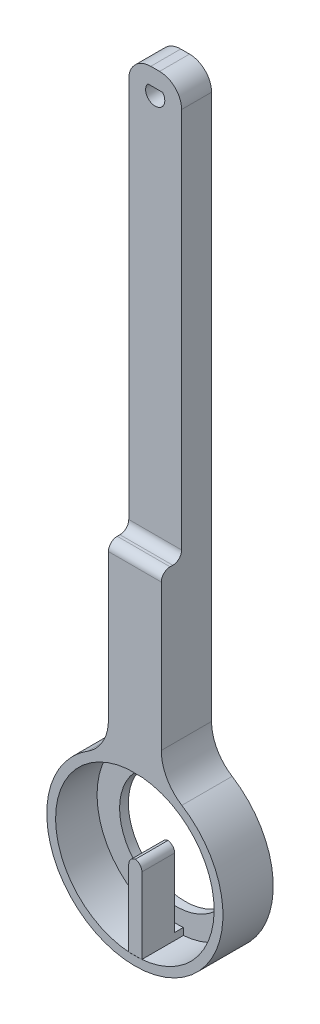
ISO-10303-21;
HEADER;
FILE_DESCRIPTION(('STEP AP214'),'2;1');
FILE_NAME('part.step','',(''),(''),'','','');
FILE_SCHEMA(('AUTOMOTIVE_DESIGN { 1 0 10303 214 1 1 1 1 }'));
ENDSEC;
DATA;
#1=APPLICATION_CONTEXT('core data for automotive mechanical design processes');
#2=APPLICATION_PROTOCOL_DEFINITION('international standard','automotive_design',2000,#1);
#3=PRODUCT_CONTEXT('',#1,'mechanical');
#4=PRODUCT('Part','Part','',(#3));
#5=PRODUCT_RELATED_PRODUCT_CATEGORY('part','',(#4));
#6=PRODUCT_DEFINITION_FORMATION('','',#4);
#7=PRODUCT_DEFINITION_CONTEXT('part definition',#1,'design');
#8=PRODUCT_DEFINITION('design','',#6,#7);
#9=PRODUCT_DEFINITION_SHAPE('','',#8);
#10=(LENGTH_UNIT() NAMED_UNIT(*) SI_UNIT(.MILLI.,.METRE.));
#11=(NAMED_UNIT(*) PLANE_ANGLE_UNIT() SI_UNIT($,.RADIAN.));
#12=(NAMED_UNIT(*) SI_UNIT($,.STERADIAN.) SOLID_ANGLE_UNIT());
#13=UNCERTAINTY_MEASURE_WITH_UNIT(LENGTH_MEASURE(1.E-05),#10,'distance_accuracy_value','');
#14=(GEOMETRIC_REPRESENTATION_CONTEXT(3) GLOBAL_UNCERTAINTY_ASSIGNED_CONTEXT((#13)) GLOBAL_UNIT_ASSIGNED_CONTEXT((#10,
#11,#12)) REPRESENTATION_CONTEXT('',''));
#15=CARTESIAN_POINT('',(0.,0.,0.));
#16=DIRECTION('',(0.,0.,1.));
#17=DIRECTION('',(1.,0.,0.));
#18=AXIS2_PLACEMENT_3D('',#15,#16,#17);
#19=CARTESIAN_POINT('',(0.359349427132485,-88.1961999037174,24.));
#20=DIRECTION('',(0.,0.,-1.));
#21=DIRECTION('',(-1.,0.,0.));
#22=AXIS2_PLACEMENT_3D('',#19,#20,#21);
#23=CYLINDRICAL_SURFACE('',#22,1.75);
#24=DIRECTION('',(0.,0.,-1.));
#25=VECTOR('',#24,1.);
#26=CARTESIAN_POINT('',(-1.39065057286751,-88.1961999037174,24.));
#27=LINE('',#26,#25);
#28=CARTESIAN_POINT('',(-1.39065057286751,-88.1961999037174,11.4140859188602));
#29=VERTEX_POINT('',#28);
#30=CARTESIAN_POINT('',(-1.39065057286751,-88.1961999037174,4.));
#31=VERTEX_POINT('',#30);
#32=EDGE_CURVE('E135',#29,#31,#27,.T.);
#33=ORIENTED_EDGE('',*,*,#32,.F.);
#34=CARTESIAN_POINT('',(0.359349427132485,-88.1961999037174,11.4140859188602));
#35=DIRECTION('',(0.,0.,1.));
#36=DIRECTION('',(0.,-1.,0.));
#37=AXIS2_PLACEMENT_3D('',#34,#35,#36);
#38=CIRCLE('',#37,1.75);
#39=CARTESIAN_POINT('',(0.109349427132485,-86.4641490961485,11.4140859188602));
#40=VERTEX_POINT('',#39);
#41=EDGE_CURVE('E128',#29,#40,#38,.F.);
#42=ORIENTED_EDGE('',*,*,#41,.T.);
#43=DIRECTION('',(0.,0.,-1.));
#44=VECTOR('',#43,1.);
#45=CARTESIAN_POINT('',(0.109349427132484,-86.4641490961485,13.));
#46=LINE('',#45,#44);
#47=CARTESIAN_POINT('',(0.109349427132484,-86.4641490961485,4.));
#48=VERTEX_POINT('',#47);
#49=EDGE_CURVE('E127',#48,#40,#46,.F.);
#50=ORIENTED_EDGE('',*,*,#49,.F.);
#51=CARTESIAN_POINT('',(0.359349427132485,-88.1961999037174,4.));
#52=DIRECTION('',(0.,0.,-1.));
#53=DIRECTION('',(-1.,0.,0.));
#54=AXIS2_PLACEMENT_3D('',#51,#52,#53);
#55=CIRCLE('',#54,1.75);
#56=EDGE_CURVE('E80',#48,#31,#55,.F.);
#57=ORIENTED_EDGE('',*,*,#56,.T.);
#58=EDGE_LOOP('',(#33,#42,#50,#57));
#59=FACE_BOUND('',#58,.T.);
#60=ADVANCED_FACE('F59',(#59),#23,.T.);
#61=CARTESIAN_POINT('',(-0.140650572867517,-88.1961999037174,24.));
#62=DIRECTION('',(0.,0.,-1.));
#63=DIRECTION('',(-1.,0.,0.));
#64=AXIS2_PLACEMENT_3D('',#61,#62,#63);
#65=CYLINDRICAL_SURFACE('',#64,1.75);
#66=ORIENTED_EDGE('',*,*,#49,.T.);
#67=CARTESIAN_POINT('',(-0.140650572867517,-88.1961999037174,11.4140859188602));
#68=DIRECTION('',(0.,0.,1.));
#69=DIRECTION('',(0.,-1.,0.));
#70=AXIS2_PLACEMENT_3D('',#67,#68,#69);
#71=CIRCLE('',#70,1.75);
#72=CARTESIAN_POINT('',(1.60934942713248,-88.1961999037174,11.4140859188602));
#73=VERTEX_POINT('',#72);
#74=EDGE_CURVE('E116',#40,#73,#71,.F.);
#75=ORIENTED_EDGE('',*,*,#74,.T.);
#76=DIRECTION('',(0.,0.,-1.));
#77=VECTOR('',#76,1.);
#78=CARTESIAN_POINT('',(1.60934942713248,-88.1961999037174,24.));
#79=LINE('',#78,#77);
#80=CARTESIAN_POINT('',(1.60934942713248,-88.1961999037174,4.));
#81=VERTEX_POINT('',#80);
#82=EDGE_CURVE('E125',#81,#73,#79,.F.);
#83=ORIENTED_EDGE('',*,*,#82,.F.);
#84=CARTESIAN_POINT('',(-0.140650572867517,-88.1961999037174,4.));
#85=DIRECTION('',(0.,0.,-1.));
#86=DIRECTION('',(-1.,0.,0.));
#87=AXIS2_PLACEMENT_3D('',#84,#85,#86);
#88=CIRCLE('',#87,1.75);
#89=EDGE_CURVE('E138',#81,#48,#88,.F.);
#90=ORIENTED_EDGE('',*,*,#89,.T.);
#91=EDGE_LOOP('',(#66,#75,#83,#90));
#92=FACE_BOUND('',#91,.T.);
#93=ADVANCED_FACE('F124',(#92),#65,.T.);
#94=CARTESIAN_POINT('',(-1.39065057286751,-105.446199903717,24.));
#95=DIRECTION('',(-1.,0.,0.));
#96=DIRECTION('',(0.,0.,1.));
#97=AXIS2_PLACEMENT_3D('',#94,#95,#96);
#98=PLANE('',#97);
#99=DIRECTION('',(0.,0.,-1.));
#100=VECTOR('',#99,1.);
#101=CARTESIAN_POINT('',(-1.39065057286751,-105.446199903717,24.));
#102=LINE('',#101,#100);
#103=CARTESIAN_POINT('',(-1.39065057286751,-105.446199903717,11.4140859188602));
#104=VERTEX_POINT('',#103);
#105=CARTESIAN_POINT('',(-1.39065057286751,-105.446199903717,2.));
#106=VERTEX_POINT('',#105);
#107=EDGE_CURVE('E136',#104,#106,#102,.T.);
#108=ORIENTED_EDGE('',*,*,#107,.F.);
#109=DIRECTION('',(0.,1.,0.));
#110=VECTOR('',#109,1.);
#111=CARTESIAN_POINT('',(-1.39065057286751,-105.446199903717,11.4140859188602));
#112=LINE('',#111,#110);
#113=EDGE_CURVE('E129',#104,#29,#112,.T.);
#114=ORIENTED_EDGE('',*,*,#113,.T.);
#115=ORIENTED_EDGE('',*,*,#32,.T.);
#116=DIRECTION('',(0.,-1.,0.));
#117=VECTOR('',#116,1.);
#118=CARTESIAN_POINT('',(-1.39065057286751,-105.446199903717,4.));
#119=LINE('',#118,#117);
#120=CARTESIAN_POINT('',(-1.39065057286751,-103.836744529305,4.));
#121=VERTEX_POINT('',#120);
#122=EDGE_CURVE('E163',#31,#121,#119,.T.);
#123=ORIENTED_EDGE('',*,*,#122,.T.);
#124=DIRECTION('',(0.,0.,-1.));
#125=VECTOR('',#124,1.);
#126=CARTESIAN_POINT('',(-1.39065057286751,-103.836744529305,4.));
#127=LINE('',#126,#125);
#128=CARTESIAN_POINT('',(-1.39065057286751,-103.836744529305,2.));
#129=VERTEX_POINT('',#128);
#130=EDGE_CURVE('E146',#129,#121,#127,.F.);
#131=ORIENTED_EDGE('',*,*,#130,.F.);
#132=DIRECTION('',(0.,1.,0.));
#133=VECTOR('',#132,1.);
#134=CARTESIAN_POINT('',(-1.39065057286751,-105.446199903717,2.));
#135=LINE('',#134,#133);
#136=EDGE_CURVE('E145',#106,#129,#135,.T.);
#137=ORIENTED_EDGE('',*,*,#136,.F.);
#138=EDGE_LOOP('',(#108,#114,#115,#123,#131,#137));
#139=FACE_BOUND('',#138,.T.);
#140=ADVANCED_FACE('F162',(#139),#98,.T.);
#141=CARTESIAN_POINT('',(-1.39065057286751,-105.446199903717,24.));
#142=DIRECTION('',(-0.00609617310807327,0.999981418164076,0.));
#143=DIRECTION('',(-0.999981418164076,-0.00609617310807327,0.));
#144=AXIS2_PLACEMENT_3D('',#141,#142,#143);
#145=PLANE('',#144);
#146=DIRECTION('',(0.999981418164076,0.00609617310807327,0.));
#147=VECTOR('',#146,1.);
#148=CARTESIAN_POINT('',(-1.39065057286751,-105.446199903717,11.4140859188602));
#149=LINE('',#148,#147);
#150=CARTESIAN_POINT('',(1.60934942713249,-105.427911044553,11.4140859188602));
#151=VERTEX_POINT('',#150);
#152=EDGE_CURVE('E73',#104,#151,#149,.T.);
#153=ORIENTED_EDGE('',*,*,#152,.F.);
#154=ORIENTED_EDGE('',*,*,#107,.T.);
#155=DIRECTION('',(0.999981418164076,0.00609617310807327,0.));
#156=VECTOR('',#155,1.);
#157=CARTESIAN_POINT('',(-1.39065057286751,-105.446199903717,2.));
#158=LINE('',#157,#156);
#159=CARTESIAN_POINT('',(1.60934942713249,-105.427911044553,2.));
#160=VERTEX_POINT('',#159);
#161=EDGE_CURVE('E168',#106,#160,#158,.T.);
#162=ORIENTED_EDGE('',*,*,#161,.T.);
#163=DIRECTION('',(0.,0.,-1.));
#164=VECTOR('',#163,1.);
#165=CARTESIAN_POINT('',(1.60934942713249,-105.427911044553,24.));
#166=LINE('',#165,#164);
#167=EDGE_CURVE('E140',#151,#160,#166,.T.);
#168=ORIENTED_EDGE('',*,*,#167,.F.);
#169=EDGE_LOOP('',(#153,#154,#162,#168));
#170=FACE_BOUND('',#169,.T.);
#171=ADVANCED_FACE('F175',(#170),#145,.F.);
#172=CARTESIAN_POINT('',(1.60934942713248,-86.4461999037174,24.));
#173=DIRECTION('',(1.,0.,0.));
#174=DIRECTION('',(0.,1.,0.));
#175=AXIS2_PLACEMENT_3D('',#172,#173,#174);
#176=PLANE('',#175);
#177=ORIENTED_EDGE('',*,*,#82,.T.);
#178=DIRECTION('',(0.,-1.,0.));
#179=VECTOR('',#178,1.);
#180=CARTESIAN_POINT('',(1.60934942713248,-86.4461999037174,11.4140859188602));
#181=LINE('',#180,#179);
#182=EDGE_CURVE('E12',#73,#151,#181,.T.);
#183=ORIENTED_EDGE('',*,*,#182,.T.);
#184=ORIENTED_EDGE('',*,*,#167,.T.);
#185=DIRECTION('',(0.,-1.,0.));
#186=VECTOR('',#185,1.);
#187=CARTESIAN_POINT('',(1.60934942713248,-86.4461999037174,2.));
#188=LINE('',#187,#186);
#189=CARTESIAN_POINT('',(1.60934942713249,-103.81665177826,2.));
#190=VERTEX_POINT('',#189);
#191=EDGE_CURVE('E169',#190,#160,#188,.T.);
#192=ORIENTED_EDGE('',*,*,#191,.F.);
#193=DIRECTION('',(0.,0.,-1.));
#194=VECTOR('',#193,1.);
#195=CARTESIAN_POINT('',(1.60934942713249,-103.81665177826,4.));
#196=LINE('',#195,#194);
#197=CARTESIAN_POINT('',(1.60934942713249,-103.81665177826,4.));
#198=VERTEX_POINT('',#197);
#199=EDGE_CURVE('E153',#198,#190,#196,.T.);
#200=ORIENTED_EDGE('',*,*,#199,.F.);
#201=DIRECTION('',(0.,1.,0.));
#202=VECTOR('',#201,1.);
#203=CARTESIAN_POINT('',(1.60934942713248,-86.4461999037174,4.));
#204=LINE('',#203,#202);
#205=EDGE_CURVE('E134',#198,#81,#204,.T.);
#206=ORIENTED_EDGE('',*,*,#205,.T.);
#207=EDGE_LOOP('',(#177,#183,#184,#192,#200,#206));
#208=FACE_BOUND('',#207,.T.);
#209=ADVANCED_FACE('F132',(#208),#176,.T.);
#210=CARTESIAN_POINT('',(0.,0.,2.));
#211=DIRECTION('',(0.,0.,-1.));
#212=DIRECTION('',(-1.,0.,0.));
#213=AXIS2_PLACEMENT_3D('',#210,#211,#212);
#214=PLANE('',#213);
#215=CARTESIAN_POINT('',(0.,-87.5,2.));
#216=DIRECTION('',(0.,0.,-1.));
#217=DIRECTION('',(-1.,0.,0.));
#218=AXIS2_PLACEMENT_3D('',#215,#216,#217);
#219=CIRCLE('',#218,16.3958266284931);
#220=EDGE_CURVE('E66',#190,#129,#219,.T.);
#221=ORIENTED_EDGE('',*,*,#220,.F.);
#222=ORIENTED_EDGE('',*,*,#191,.T.);
#223=ORIENTED_EDGE('',*,*,#161,.F.);
#224=ORIENTED_EDGE('',*,*,#136,.T.);
#225=EDGE_LOOP('',(#221,#222,#223,#224));
#226=FACE_BOUND('',#225,.T.);
#227=ADVANCED_FACE('F166',(#226),#214,.T.);
#228=CARTESIAN_POINT('',(0.,-87.5,4.));
#229=DIRECTION('',(0.,0.,-1.));
#230=DIRECTION('',(-1.,0.,0.));
#231=AXIS2_PLACEMENT_3D('',#228,#229,#230);
#232=CYLINDRICAL_SURFACE('',#231,16.3958266284931);
#233=ORIENTED_EDGE('',*,*,#130,.T.);
#234=CARTESIAN_POINT('',(0.,-87.5,4.));
#235=DIRECTION('',(0.,0.,-1.));
#236=DIRECTION('',(-1.,0.,0.));
#237=AXIS2_PLACEMENT_3D('',#234,#235,#236);
#238=CIRCLE('',#237,16.3958266284931);
#239=EDGE_CURVE('E181',#198,#121,#238,.T.);
#240=ORIENTED_EDGE('',*,*,#239,.F.);
#241=ORIENTED_EDGE('',*,*,#199,.T.);
#242=ORIENTED_EDGE('',*,*,#220,.T.);
#243=EDGE_LOOP('',(#233,#240,#241,#242));
#244=FACE_BOUND('',#243,.T.);
#245=ADVANCED_FACE('F150',(#244),#232,.F.);
#246=CARTESIAN_POINT('',(0.,-87.5,4.));
#247=DIRECTION('',(0.,0.,-1.));
#248=DIRECTION('',(-1.,0.,0.));
#249=AXIS2_PLACEMENT_3D('',#246,#247,#248);
#250=PLANE('',#249);
#251=ORIENTED_EDGE('',*,*,#56,.F.);
#252=ORIENTED_EDGE('',*,*,#89,.F.);
#253=ORIENTED_EDGE('',*,*,#205,.F.);
#254=ORIENTED_EDGE('',*,*,#239,.T.);
#255=ORIENTED_EDGE('',*,*,#122,.F.);
#256=EDGE_LOOP('',(#251,#252,#253,#254,#255));
#257=FACE_BOUND('',#256,.T.);
#258=ADVANCED_FACE('F187',(#257),#250,.T.);
#259=CARTESIAN_POINT('',(-35.,-27.0166279198616,11.4140859188601));
#260=DIRECTION('',(0.,0.,1.));
#261=DIRECTION('',(0.,-1.,0.));
#262=AXIS2_PLACEMENT_3D('',#259,#260,#261);
#263=PLANE('',#262);
#264=ORIENTED_EDGE('',*,*,#113,.F.);
#265=ORIENTED_EDGE('',*,*,#152,.T.);
#266=ORIENTED_EDGE('',*,*,#182,.F.);
#267=ORIENTED_EDGE('',*,*,#74,.F.);
#268=ORIENTED_EDGE('',*,*,#41,.F.);
#269=EDGE_LOOP('',(#264,#265,#266,#267,#268));
#270=FACE_BOUND('',#269,.T.);
#271=ADVANCED_FACE('F115',(#270),#263,.T.);
#272=CLOSED_SHELL('',(#60,#93,#140,#171,#209,#227,#245,#258,#271));
#273=MANIFOLD_SOLID_BREP('B2',#272);
#274=CARTESIAN_POINT('',(0.,-87.5,13.));
#275=DIRECTION('',(0.,0.,-1.));
#276=DIRECTION('',(-1.,0.,0.));
#277=AXIS2_PLACEMENT_3D('',#274,#275,#276);
#278=CYLINDRICAL_SURFACE('',#277,20.);
#279=CARTESIAN_POINT('',(0.,-87.5,11.4140859188602));
#280=DIRECTION('',(0.,0.,1.));
#281=DIRECTION('',(0.,-1.,0.));
#282=AXIS2_PLACEMENT_3D('',#279,#280,#281);
#283=CIRCLE('',#282,20.);
#284=CARTESIAN_POINT('',(-10.6666666666667,-70.581896612734,11.4140859188602));
#285=VERTEX_POINT('',#284);
#286=CARTESIAN_POINT('',(10.6666666666667,-70.581896612734,11.4140859188602));
#287=VERTEX_POINT('',#286);
#288=EDGE_CURVE('E400',#285,#287,#283,.T.);
#289=ORIENTED_EDGE('',*,*,#288,.F.);
#290=DIRECTION('',(0.,0.,-1.));
#291=VECTOR('',#290,1.);
#292=CARTESIAN_POINT('',(-10.6666666666667,-70.581896612734,13.));
#293=LINE('',#292,#291);
#294=CARTESIAN_POINT('',(-10.6666666666667,-70.581896612734,0.));
#295=VERTEX_POINT('',#294);
#296=EDGE_CURVE('E491',#285,#295,#293,.T.);
#297=ORIENTED_EDGE('',*,*,#296,.T.);
#298=CARTESIAN_POINT('',(0.,-87.5,0.));
#299=DIRECTION('',(0.,0.,1.));
#300=DIRECTION('',(1.,0.,0.));
#301=AXIS2_PLACEMENT_3D('',#298,#299,#300);
#302=CIRCLE('',#301,20.);
#303=CARTESIAN_POINT('',(10.6666666666667,-70.581896612734,0.));
#304=VERTEX_POINT('',#303);
#305=EDGE_CURVE('E444',#295,#304,#302,.T.);
#306=ORIENTED_EDGE('',*,*,#305,.T.);
#307=DIRECTION('',(0.,0.,-1.));
#308=VECTOR('',#307,1.);
#309=CARTESIAN_POINT('',(10.6666666666667,-70.581896612734,13.));
#310=LINE('',#309,#308);
#311=EDGE_CURVE('E488',#304,#287,#310,.F.);
#312=ORIENTED_EDGE('',*,*,#311,.T.);
#313=EDGE_LOOP('',(#289,#297,#306,#312));
#314=FACE_BOUND('',#313,.T.);
#315=ADVANCED_FACE('F261',(#314),#278,.T.);
#316=CARTESIAN_POINT('',(0.,-87.5000000000001,2.));
#317=DIRECTION('',(0.,0.,1.));
#318=DIRECTION('',(1.,0.,0.));
#319=AXIS2_PLACEMENT_3D('',#316,#317,#318);
#320=CYLINDRICAL_SURFACE('',#319,18.);
#321=CARTESIAN_POINT('',(0.,-87.5000000000001,11.4140859188602));
#322=DIRECTION('',(0.,0.,1.));
#323=DIRECTION('',(0.,-1.,0.));
#324=AXIS2_PLACEMENT_3D('',#321,#322,#323);
#325=CIRCLE('',#324,18.);
#326=CARTESIAN_POINT('',(1.78406217918483,-69.5886314833065,11.4140859188602));
#327=VERTEX_POINT('',#326);
#328=CARTESIAN_POINT('',(-1.78406217918483,-69.5886314833065,11.4140859188602));
#329=VERTEX_POINT('',#328);
#330=EDGE_CURVE('E407',#327,#329,#325,.F.);
#331=ORIENTED_EDGE('',*,*,#330,.F.);
#332=DIRECTION('',(0.,0.,1.));
#333=VECTOR('',#332,1.);
#334=CARTESIAN_POINT('',(1.78406217918483,-69.5886314833065,2.));
#335=LINE('',#334,#333);
#336=CARTESIAN_POINT('',(1.78406217918483,-69.5886314833065,2.));
#337=VERTEX_POINT('',#336);
#338=EDGE_CURVE('E433',#327,#337,#335,.F.);
#339=ORIENTED_EDGE('',*,*,#338,.T.);
#340=CARTESIAN_POINT('',(0.,-87.5000000000001,2.));
#341=DIRECTION('',(0.,0.,1.));
#342=DIRECTION('',(1.,0.,0.));
#343=AXIS2_PLACEMENT_3D('',#340,#341,#342);
#344=CIRCLE('',#343,18.);
#345=CARTESIAN_POINT('',(-1.78406217918483,-69.5886314833065,2.));
#346=VERTEX_POINT('',#345);
#347=EDGE_CURVE('E439',#346,#337,#344,.T.);
#348=ORIENTED_EDGE('',*,*,#347,.F.);
#349=DIRECTION('',(0.,0.,1.));
#350=VECTOR('',#349,1.);
#351=CARTESIAN_POINT('',(-1.78406217918483,-69.5886314833065,2.));
#352=LINE('',#351,#350);
#353=EDGE_CURVE('E428',#346,#329,#352,.T.);
#354=ORIENTED_EDGE('',*,*,#353,.T.);
#355=EDGE_LOOP('',(#331,#339,#348,#354));
#356=FACE_BOUND('',#355,.T.);
#357=ADVANCED_FACE('F562',(#356),#320,.F.);
#358=CARTESIAN_POINT('',(5.99999999999998,-69.5886314833065,15.8));
#359=DIRECTION('',(0.,-1.,0.));
#360=DIRECTION('',(0.,0.,-1.));
#361=AXIS2_PLACEMENT_3D('',#358,#359,#360);
#362=PLANE('',#361);
#363=ORIENTED_EDGE('',*,*,#338,.F.);
#364=DIRECTION('',(-1.,0.,0.));
#365=VECTOR('',#364,1.);
#366=CARTESIAN_POINT('',(5.99999999999998,-69.5886314833065,11.4140859188602));
#367=LINE('',#366,#365);
#368=EDGE_CURVE('E404',#327,#329,#367,.T.);
#369=ORIENTED_EDGE('',*,*,#368,.T.);
#370=ORIENTED_EDGE('',*,*,#353,.F.);
#371=DIRECTION('',(1.,0.,0.));
#372=VECTOR('',#371,1.);
#373=CARTESIAN_POINT('',(0.,-69.5886314833065,2.));
#374=LINE('',#373,#372);
#375=EDGE_CURVE('E447',#346,#337,#374,.T.);
#376=ORIENTED_EDGE('',*,*,#375,.T.);
#377=EDGE_LOOP('',(#363,#369,#370,#376));
#378=FACE_BOUND('',#377,.T.);
#379=ADVANCED_FACE('F569',(#378),#362,.T.);
#380=CARTESIAN_POINT('',(5.99999999999998,-69.5886314833065,15.8));
#381=DIRECTION('',(1.,0.,0.));
#382=DIRECTION('',(0.,0.,-1.));
#383=AXIS2_PLACEMENT_3D('',#380,#381,#382);
#384=PLANE('',#383);
#385=DIRECTION('',(0.,-1.,0.));
#386=VECTOR('',#385,1.);
#387=CARTESIAN_POINT('',(5.99999999999998,-69.5886314833065,11.4140859188602));
#388=LINE('',#387,#386);
#389=CARTESIAN_POINT('',(5.99999999999998,-29.0166279198616,11.4140859188601));
#390=VERTEX_POINT('',#389);
#391=CARTESIAN_POINT('',(5.99999999999998,-62.1228449191009,11.4140859188601));
#392=VERTEX_POINT('',#391);
#393=EDGE_CURVE('E402',#390,#392,#388,.T.);
#394=ORIENTED_EDGE('',*,*,#393,.T.);
#395=DIRECTION('',(0.,0.,-1.));
#396=VECTOR('',#395,1.);
#397=CARTESIAN_POINT('',(5.99999999999998,-62.1228449191009,15.8));
#398=LINE('',#397,#396);
#399=CARTESIAN_POINT('',(5.99999999999998,-62.1228449191009,0.));
#400=VERTEX_POINT('',#399);
#401=EDGE_CURVE('E276',#392,#400,#398,.T.);
#402=ORIENTED_EDGE('',*,*,#401,.T.);
#403=DIRECTION('',(0.,-1.,0.));
#404=VECTOR('',#403,1.);
#405=CARTESIAN_POINT('',(5.99999999999998,-69.5886314833065,0.));
#406=LINE('',#405,#404);
#407=CARTESIAN_POINT('',(5.99999999999998,61.5832427245863,0.));
#408=VERTEX_POINT('',#407);
#409=EDGE_CURVE('E418',#408,#400,#406,.T.);
#410=ORIENTED_EDGE('',*,*,#409,.F.);
#411=DIRECTION('',(0.,0.,-1.));
#412=VECTOR('',#411,1.);
#413=CARTESIAN_POINT('',(5.99999999999998,61.5832427245863,15.8));
#414=LINE('',#413,#412);
#415=CARTESIAN_POINT('',(5.99999999999998,61.5832427245863,6.79999999999999));
#416=VERTEX_POINT('',#415);
#417=EDGE_CURVE('E459',#408,#416,#414,.F.);
#418=ORIENTED_EDGE('',*,*,#417,.T.);
#419=DIRECTION('',(0.,-1.,0.));
#420=VECTOR('',#419,1.);
#421=CARTESIAN_POINT('',(5.99999999999998,-27.0166279198616,6.79999999999999));
#422=LINE('',#421,#420);
#423=CARTESIAN_POINT('',(5.99999999999998,-25.0166279198616,6.79999999999999));
#424=VERTEX_POINT('',#423);
#425=EDGE_CURVE('E410',#416,#424,#422,.T.);
#426=ORIENTED_EDGE('',*,*,#425,.T.);
#427=CARTESIAN_POINT('',(5.99999999999998,-25.0166279198616,8.79999999999999));
#428=DIRECTION('',(1.,0.,0.));
#429=DIRECTION('',(0.,0.,-1.));
#430=AXIS2_PLACEMENT_3D('',#427,#428,#429);
#431=CIRCLE('',#430,2.);
#432=CARTESIAN_POINT('',(5.99999999999998,-27.0166279198616,8.79999999999999));
#433=VERTEX_POINT('',#432);
#434=EDGE_CURVE('E486',#424,#433,#431,.F.);
#435=ORIENTED_EDGE('',*,*,#434,.T.);
#436=DIRECTION('',(0.,0.,-1.));
#437=VECTOR('',#436,1.);
#438=CARTESIAN_POINT('',(5.99999999999998,-27.0166279198616,15.8));
#439=LINE('',#438,#437);
#440=CARTESIAN_POINT('',(5.99999999999998,-27.0166279198616,9.41408591886015));
#441=VERTEX_POINT('',#440);
#442=EDGE_CURVE('E425',#441,#433,#439,.T.);
#443=ORIENTED_EDGE('',*,*,#442,.F.);
#444=CARTESIAN_POINT('',(5.99999999999998,-29.0166279198616,9.41408591886015));
#445=DIRECTION('',(1.,0.,0.));
#446=DIRECTION('',(0.,0.,-1.));
#447=AXIS2_PLACEMENT_3D('',#444,#445,#446);
#448=CIRCLE('',#447,2.);
#449=EDGE_CURVE('E477',#441,#390,#448,.T.);
#450=ORIENTED_EDGE('',*,*,#449,.T.);
#451=EDGE_LOOP('',(#394,#402,#410,#418,#426,#435,#443,#450));
#452=FACE_BOUND('',#451,.T.);
#453=ADVANCED_FACE('F534',(#452),#384,.T.);
#454=CARTESIAN_POINT('',(-6.00000000000002,-69.5886314833065,15.8));
#455=DIRECTION('',(-1.,0.,0.));
#456=DIRECTION('',(0.,0.,1.));
#457=AXIS2_PLACEMENT_3D('',#454,#455,#456);
#458=PLANE('',#457);
#459=DIRECTION('',(0.,1.,0.));
#460=VECTOR('',#459,1.);
#461=CARTESIAN_POINT('',(-6.00000000000002,-69.5886314833065,0.));
#462=LINE('',#461,#460);
#463=CARTESIAN_POINT('',(-6.00000000000002,-62.122844919101,0.));
#464=VERTEX_POINT('',#463);
#465=CARTESIAN_POINT('',(-6.00000000000002,61.5832427245863,0.));
#466=VERTEX_POINT('',#465);
#467=EDGE_CURVE('E422',#464,#466,#462,.T.);
#468=ORIENTED_EDGE('',*,*,#467,.F.);
#469=DIRECTION('',(0.,0.,-1.));
#470=VECTOR('',#469,1.);
#471=CARTESIAN_POINT('',(-6.00000000000002,-62.122844919101,15.8));
#472=LINE('',#471,#470);
#473=CARTESIAN_POINT('',(-6.00000000000002,-62.122844919101,11.4140859188601));
#474=VERTEX_POINT('',#473);
#475=EDGE_CURVE('E494',#464,#474,#472,.F.);
#476=ORIENTED_EDGE('',*,*,#475,.T.);
#477=DIRECTION('',(0.,1.,0.));
#478=VECTOR('',#477,1.);
#479=CARTESIAN_POINT('',(-6.00000000000002,-69.5886314833065,11.4140859188602));
#480=LINE('',#479,#478);
#481=CARTESIAN_POINT('',(-6.00000000000002,-29.0166279198616,11.4140859188601));
#482=VERTEX_POINT('',#481);
#483=EDGE_CURVE('E397',#474,#482,#480,.T.);
#484=ORIENTED_EDGE('',*,*,#483,.T.);
#485=CARTESIAN_POINT('',(-6.00000000000002,-29.0166279198616,9.41408591886015));
#486=DIRECTION('',(-1.,0.,0.));
#487=DIRECTION('',(0.,0.,1.));
#488=AXIS2_PLACEMENT_3D('',#485,#486,#487);
#489=CIRCLE('',#488,2.);
#490=CARTESIAN_POINT('',(-6.00000000000002,-27.0166279198616,9.41408591886015));
#491=VERTEX_POINT('',#490);
#492=EDGE_CURVE('E482',#482,#491,#489,.T.);
#493=ORIENTED_EDGE('',*,*,#492,.T.);
#494=DIRECTION('',(0.,0.,-1.));
#495=VECTOR('',#494,1.);
#496=CARTESIAN_POINT('',(-6.00000000000002,-27.0166279198616,15.8));
#497=LINE('',#496,#495);
#498=CARTESIAN_POINT('',(-6.00000000000002,-27.0166279198616,8.79999999999999));
#499=VERTEX_POINT('',#498);
#500=EDGE_CURVE('E424',#491,#499,#497,.T.);
#501=ORIENTED_EDGE('',*,*,#500,.T.);
#502=CARTESIAN_POINT('',(-6.00000000000002,-25.0166279198616,8.79999999999999));
#503=DIRECTION('',(-1.,0.,0.));
#504=DIRECTION('',(0.,0.,1.));
#505=AXIS2_PLACEMENT_3D('',#502,#503,#504);
#506=CIRCLE('',#505,2.);
#507=CARTESIAN_POINT('',(-6.00000000000002,-25.0166279198616,6.79999999999999));
#508=VERTEX_POINT('',#507);
#509=EDGE_CURVE('E484',#499,#508,#506,.F.);
#510=ORIENTED_EDGE('',*,*,#509,.T.);
#511=DIRECTION('',(0.,1.,0.));
#512=VECTOR('',#511,1.);
#513=CARTESIAN_POINT('',(-6.00000000000002,-27.0166279198616,6.79999999999999));
#514=LINE('',#513,#512);
#515=CARTESIAN_POINT('',(-6.00000000000002,61.5832427245863,6.79999999999999));
#516=VERTEX_POINT('',#515);
#517=EDGE_CURVE('E413',#508,#516,#514,.T.);
#518=ORIENTED_EDGE('',*,*,#517,.T.);
#519=DIRECTION('',(0.,0.,-1.));
#520=VECTOR('',#519,1.);
#521=CARTESIAN_POINT('',(-6.00000000000002,61.5832427245863,15.8));
#522=LINE('',#521,#520);
#523=EDGE_CURVE('E466',#516,#466,#522,.T.);
#524=ORIENTED_EDGE('',*,*,#523,.T.);
#525=EDGE_LOOP('',(#468,#476,#484,#493,#501,#510,#518,#524));
#526=FACE_BOUND('',#525,.T.);
#527=ADVANCED_FACE('F517',(#526),#458,.T.);
#528=CARTESIAN_POINT('',(5.99999999999998,-27.0166279198616,15.8));
#529=DIRECTION('',(0.,1.,0.));
#530=DIRECTION('',(0.,0.,1.));
#531=AXIS2_PLACEMENT_3D('',#528,#529,#530);
#532=PLANE('',#531);
#533=ORIENTED_EDGE('',*,*,#442,.T.);
#534=DIRECTION('',(-1.,0.,0.));
#535=VECTOR('',#534,1.);
#536=CARTESIAN_POINT('',(-6.00000000000002,-27.0166279198616,8.79999999999999));
#537=LINE('',#536,#535);
#538=EDGE_CURVE('E472',#433,#499,#537,.T.);
#539=ORIENTED_EDGE('',*,*,#538,.T.);
#540=ORIENTED_EDGE('',*,*,#500,.F.);
#541=DIRECTION('',(1.,0.,0.));
#542=VECTOR('',#541,1.);
#543=CARTESIAN_POINT('',(5.99999999999998,-27.0166279198616,9.41408591886015));
#544=LINE('',#543,#542);
#545=EDGE_CURVE('E469',#491,#441,#544,.T.);
#546=ORIENTED_EDGE('',*,*,#545,.T.);
#547=EDGE_LOOP('',(#533,#539,#540,#546));
#548=FACE_BOUND('',#547,.T.);
#549=ADVANCED_FACE('F546',(#548),#532,.T.);
#550=CARTESIAN_POINT('',(0.,0.,0.));
#551=DIRECTION('',(0.,0.,1.));
#552=DIRECTION('',(1.,0.,0.));
#553=AXIS2_PLACEMENT_3D('',#550,#551,#552);
#554=PLANE('',#553);
#555=DIRECTION('',(1.,0.,0.));
#556=VECTOR('',#555,1.);
#557=CARTESIAN_POINT('',(5.99999999999998,66.5832427245863,0.));
#558=LINE('',#557,#556);
#559=CARTESIAN_POINT('',(-1.00000000000002,66.5832427245863,0.));
#560=VERTEX_POINT('',#559);
#561=CARTESIAN_POINT('',(0.999999999999984,66.5832427245863,0.));
#562=VERTEX_POINT('',#561);
#563=EDGE_CURVE('E409',#560,#562,#558,.T.);
#564=ORIENTED_EDGE('',*,*,#563,.T.);
#565=CARTESIAN_POINT('',(0.999999999999984,61.5832427245863,0.));
#566=DIRECTION('',(0.,0.,1.));
#567=DIRECTION('',(1.,0.,0.));
#568=AXIS2_PLACEMENT_3D('',#565,#566,#567);
#569=CIRCLE('',#568,5.);
#570=EDGE_CURVE('E457',#562,#408,#569,.F.);
#571=ORIENTED_EDGE('',*,*,#570,.T.);
#572=ORIENTED_EDGE('',*,*,#409,.T.);
#573=CARTESIAN_POINT('',(16.,-62.1228449191009,0.));
#574=DIRECTION('',(0.,0.,1.));
#575=DIRECTION('',(1.,0.,0.));
#576=AXIS2_PLACEMENT_3D('',#573,#574,#575);
#577=CIRCLE('',#576,10.);
#578=EDGE_CURVE('E57',#400,#304,#577,.T.);
#579=ORIENTED_EDGE('',*,*,#578,.T.);
#580=ORIENTED_EDGE('',*,*,#305,.F.);
#581=CARTESIAN_POINT('',(-16.,-62.122844919101,0.));
#582=DIRECTION('',(0.,0.,1.));
#583=DIRECTION('',(1.,0.,0.));
#584=AXIS2_PLACEMENT_3D('',#581,#582,#583);
#585=CIRCLE('',#584,10.);
#586=EDGE_CURVE('E497',#295,#464,#585,.T.);
#587=ORIENTED_EDGE('',*,*,#586,.T.);
#588=ORIENTED_EDGE('',*,*,#467,.T.);
#589=CARTESIAN_POINT('',(-1.00000000000002,61.5832427245863,0.));
#590=DIRECTION('',(0.,0.,1.));
#591=DIRECTION('',(1.,0.,0.));
#592=AXIS2_PLACEMENT_3D('',#589,#590,#591);
#593=CIRCLE('',#592,5.);
#594=EDGE_CURVE('E455',#466,#560,#593,.F.);
#595=ORIENTED_EDGE('',*,*,#594,.T.);
#596=EDGE_LOOP('',(#564,#571,#572,#579,#580,#587,#588,#595));
#597=FACE_BOUND('',#596,.T.);
#598=CARTESIAN_POINT('',(0.,-87.6285008033563,0.));
#599=DIRECTION('',(0.,0.,-1.));
#600=DIRECTION('',(1.,0.,0.));
#601=AXIS2_PLACEMENT_3D('',#598,#599,#600);
#602=CIRCLE('',#601,12.8844015446727);
#603=CARTESIAN_POINT('',(12.8844015446727,-87.6285008033563,0.));
#604=VERTEX_POINT('',#603);
#605=EDGE_CURVE('E435',#604,#604,#602,.T.);
#606=ORIENTED_EDGE('',*,*,#605,.F.);
#607=EDGE_LOOP('',(#606));
#608=FACE_BOUND('',#607,.T.);
#609=DIRECTION('',(-1.,0.,0.));
#610=VECTOR('',#609,1.);
#611=CARTESIAN_POINT('',(1.68000230121901,62.8029720718972,0.));
#612=LINE('',#611,#610);
#613=CARTESIAN_POINT('',(1.68000230121901,62.8029720718972,0.));
#614=VERTEX_POINT('',#613);
#615=CARTESIAN_POINT('',(-1.68000230121901,62.8029720718972,0.));
#616=VERTEX_POINT('',#615);
#617=EDGE_CURVE('E385',#614,#616,#612,.T.);
#618=ORIENTED_EDGE('',*,*,#617,.T.);
#619=CARTESIAN_POINT('',(0.,61.4178694694975,0.));
#620=DIRECTION('',(0.,0.,1.));
#621=DIRECTION('',(1.,0.,0.));
#622=AXIS2_PLACEMENT_3D('',#619,#620,#621);
#623=CIRCLE('',#622,2.17736468035916);
#624=EDGE_CURVE('E377',#616,#614,#623,.T.);
#625=ORIENTED_EDGE('',*,*,#624,.T.);
#626=EDGE_LOOP('',(#618,#625));
#627=FACE_BOUND('',#626,.T.);
#628=ADVANCED_FACE('F391',(#597,#608,#627),#554,.F.);
#629=CARTESIAN_POINT('',(0.,-87.5000000000001,2.));
#630=DIRECTION('',(0.,0.,1.));
#631=DIRECTION('',(1.,0.,0.));
#632=AXIS2_PLACEMENT_3D('',#629,#630,#631);
#633=PLANE('',#632);
#634=ORIENTED_EDGE('',*,*,#375,.F.);
#635=ORIENTED_EDGE('',*,*,#347,.T.);
#636=EDGE_LOOP('',(#634,#635));
#637=FACE_BOUND('',#636,.T.);
#638=CARTESIAN_POINT('',(0.,-87.6285008033563,2.));
#639=DIRECTION('',(0.,0.,-1.));
#640=DIRECTION('',(-1.,0.,0.));
#641=AXIS2_PLACEMENT_3D('',#638,#639,#640);
#642=CIRCLE('',#641,12.8844015446727);
#643=CARTESIAN_POINT('',(-12.8844015446727,-87.6285008033563,2.));
#644=VERTEX_POINT('',#643);
#645=EDGE_CURVE('E436',#644,#644,#642,.T.);
#646=ORIENTED_EDGE('',*,*,#645,.T.);
#647=EDGE_LOOP('',(#646));
#648=FACE_BOUND('',#647,.T.);
#649=ADVANCED_FACE('F635',(#637,#648),#633,.T.);
#650=CARTESIAN_POINT('',(0.,-87.6285008033563,2.));
#651=DIRECTION('',(0.,0.,-1.));
#652=DIRECTION('',(-1.,0.,0.));
#653=AXIS2_PLACEMENT_3D('',#650,#651,#652);
#654=CYLINDRICAL_SURFACE('',#653,12.8844015446727);
#655=ORIENTED_EDGE('',*,*,#605,.T.);
#656=EDGE_LOOP('',(#655));
#657=FACE_BOUND('',#656,.T.);
#658=ORIENTED_EDGE('',*,*,#645,.F.);
#659=EDGE_LOOP('',(#658));
#660=FACE_BOUND('',#659,.T.);
#661=ADVANCED_FACE('F629',(#657,#660),#654,.F.);
#662=CARTESIAN_POINT('',(5.99999999999998,66.5832427245863,6.79999999999999));
#663=DIRECTION('',(0.,1.,0.));
#664=DIRECTION('',(0.,0.,1.));
#665=AXIS2_PLACEMENT_3D('',#662,#663,#664);
#666=PLANE('',#665);
#667=DIRECTION('',(1.,0.,0.));
#668=VECTOR('',#667,1.);
#669=CARTESIAN_POINT('',(5.99999999999998,66.5832427245863,6.79999999999999));
#670=LINE('',#669,#668);
#671=CARTESIAN_POINT('',(-1.00000000000002,66.5832427245863,6.79999999999999));
#672=VERTEX_POINT('',#671);
#673=CARTESIAN_POINT('',(0.999999999999984,66.5832427245863,6.79999999999999));
#674=VERTEX_POINT('',#673);
#675=EDGE_CURVE('E415',#672,#674,#670,.T.);
#676=ORIENTED_EDGE('',*,*,#675,.T.);
#677=DIRECTION('',(0.,0.,-1.));
#678=VECTOR('',#677,1.);
#679=CARTESIAN_POINT('',(0.999999999999984,66.5832427245863,6.79999999999999));
#680=LINE('',#679,#678);
#681=EDGE_CURVE('E452',#674,#562,#680,.T.);
#682=ORIENTED_EDGE('',*,*,#681,.T.);
#683=ORIENTED_EDGE('',*,*,#563,.F.);
#684=DIRECTION('',(0.,0.,-1.));
#685=VECTOR('',#684,1.);
#686=CARTESIAN_POINT('',(-1.00000000000002,66.5832427245863,6.79999999999999));
#687=LINE('',#686,#685);
#688=EDGE_CURVE('E450',#560,#672,#687,.F.);
#689=ORIENTED_EDGE('',*,*,#688,.T.);
#690=EDGE_LOOP('',(#676,#682,#683,#689));
#691=FACE_BOUND('',#690,.T.);
#692=ADVANCED_FACE('F526',(#691),#666,.T.);
#693=CARTESIAN_POINT('',(0.,0.,6.79999999999999));
#694=DIRECTION('',(0.,0.,1.));
#695=DIRECTION('',(1.,0.,0.));
#696=AXIS2_PLACEMENT_3D('',#693,#694,#695);
#697=PLANE('',#696);
#698=ORIENTED_EDGE('',*,*,#517,.F.);
#699=DIRECTION('',(-1.,0.,0.));
#700=VECTOR('',#699,1.);
#701=CARTESIAN_POINT('',(5.99999999999998,-25.0166279198616,6.79999999999999));
#702=LINE('',#701,#700);
#703=EDGE_CURVE('E475',#508,#424,#702,.F.);
#704=ORIENTED_EDGE('',*,*,#703,.T.);
#705=ORIENTED_EDGE('',*,*,#425,.F.);
#706=CARTESIAN_POINT('',(0.999999999999984,61.5832427245863,6.79999999999999));
#707=DIRECTION('',(0.,0.,1.));
#708=DIRECTION('',(1.,0.,0.));
#709=AXIS2_PLACEMENT_3D('',#706,#707,#708);
#710=CIRCLE('',#709,5.);
#711=EDGE_CURVE('E464',#416,#674,#710,.T.);
#712=ORIENTED_EDGE('',*,*,#711,.T.);
#713=ORIENTED_EDGE('',*,*,#675,.F.);
#714=CARTESIAN_POINT('',(-1.00000000000002,61.5832427245863,6.79999999999999));
#715=DIRECTION('',(0.,0.,1.));
#716=DIRECTION('',(1.,0.,0.));
#717=AXIS2_PLACEMENT_3D('',#714,#715,#716);
#718=CIRCLE('',#717,5.);
#719=EDGE_CURVE('E461',#672,#516,#718,.T.);
#720=ORIENTED_EDGE('',*,*,#719,.T.);
#721=EDGE_LOOP('',(#698,#704,#705,#712,#713,#720));
#722=FACE_BOUND('',#721,.T.);
#723=CARTESIAN_POINT('',(0.,61.4178694694975,6.79999999999999));
#724=DIRECTION('',(0.,0.,1.));
#725=DIRECTION('',(1.,0.,0.));
#726=AXIS2_PLACEMENT_3D('',#723,#724,#725);
#727=CIRCLE('',#726,2.17736468035916);
#728=CARTESIAN_POINT('',(-1.68000230121901,62.8029720718972,6.79999999999999));
#729=VERTEX_POINT('',#728);
#730=CARTESIAN_POINT('',(1.68000230121901,62.8029720718972,6.79999999999999));
#731=VERTEX_POINT('',#730);
#732=EDGE_CURVE('E380',#729,#731,#727,.T.);
#733=ORIENTED_EDGE('',*,*,#732,.F.);
#734=DIRECTION('',(-1.,0.,0.));
#735=VECTOR('',#734,1.);
#736=CARTESIAN_POINT('',(1.68000230121901,62.8029720718972,6.79999999999999));
#737=LINE('',#736,#735);
#738=EDGE_CURVE('E392',#731,#729,#737,.T.);
#739=ORIENTED_EDGE('',*,*,#738,.F.);
#740=EDGE_LOOP('',(#733,#739));
#741=FACE_BOUND('',#740,.T.);
#742=ADVANCED_FACE('F538',(#722,#741),#697,.T.);
#743=CARTESIAN_POINT('',(0.999999999999984,61.5832427245863,6.79999999999999));
#744=DIRECTION('',(0.,0.,-1.));
#745=DIRECTION('',(-1.,0.,0.));
#746=AXIS2_PLACEMENT_3D('',#743,#744,#745);
#747=CYLINDRICAL_SURFACE('',#746,5.);
#748=ORIENTED_EDGE('',*,*,#711,.F.);
#749=ORIENTED_EDGE('',*,*,#417,.F.);
#750=ORIENTED_EDGE('',*,*,#570,.F.);
#751=ORIENTED_EDGE('',*,*,#681,.F.);
#752=EDGE_LOOP('',(#748,#749,#750,#751));
#753=FACE_BOUND('',#752,.T.);
#754=ADVANCED_FACE('F531',(#753),#747,.T.);
#755=CARTESIAN_POINT('',(-1.00000000000002,61.5832427245863,15.8));
#756=DIRECTION('',(0.,0.,-1.));
#757=DIRECTION('',(-1.,0.,0.));
#758=AXIS2_PLACEMENT_3D('',#755,#756,#757);
#759=CYLINDRICAL_SURFACE('',#758,5.);
#760=ORIENTED_EDGE('',*,*,#719,.F.);
#761=ORIENTED_EDGE('',*,*,#688,.F.);
#762=ORIENTED_EDGE('',*,*,#594,.F.);
#763=ORIENTED_EDGE('',*,*,#523,.F.);
#764=EDGE_LOOP('',(#760,#761,#762,#763));
#765=FACE_BOUND('',#764,.T.);
#766=ADVANCED_FACE('F522',(#765),#759,.T.);
#767=CARTESIAN_POINT('',(-35.,-27.0166279198616,11.4140859188601));
#768=DIRECTION('',(0.,0.,1.));
#769=DIRECTION('',(0.,-1.,0.));
#770=AXIS2_PLACEMENT_3D('',#767,#768,#769);
#771=PLANE('',#770);
#772=ORIENTED_EDGE('',*,*,#393,.F.);
#773=DIRECTION('',(1.,0.,0.));
#774=VECTOR('',#773,1.);
#775=CARTESIAN_POINT('',(-35.,-29.0166279198616,11.4140859188601));
#776=LINE('',#775,#774);
#777=EDGE_CURVE('E479',#390,#482,#776,.F.);
#778=ORIENTED_EDGE('',*,*,#777,.T.);
#779=ORIENTED_EDGE('',*,*,#483,.F.);
#780=CARTESIAN_POINT('',(-16.,-62.122844919101,11.4140859188602));
#781=DIRECTION('',(0.,0.,1.));
#782=DIRECTION('',(0.,-1.,0.));
#783=AXIS2_PLACEMENT_3D('',#780,#781,#782);
#784=CIRCLE('',#783,10.);
#785=EDGE_CURVE('E499',#474,#285,#784,.F.);
#786=ORIENTED_EDGE('',*,*,#785,.T.);
#787=ORIENTED_EDGE('',*,*,#288,.T.);
#788=CARTESIAN_POINT('',(16.,-62.1228449191009,11.4140859188602));
#789=DIRECTION('',(0.,0.,1.));
#790=DIRECTION('',(0.,-1.,0.));
#791=AXIS2_PLACEMENT_3D('',#788,#789,#790);
#792=CIRCLE('',#791,10.);
#793=EDGE_CURVE('E269',#287,#392,#792,.F.);
#794=ORIENTED_EDGE('',*,*,#793,.T.);
#795=EDGE_LOOP('',(#772,#778,#779,#786,#787,#794));
#796=FACE_BOUND('',#795,.T.);
#797=ORIENTED_EDGE('',*,*,#330,.T.);
#798=ORIENTED_EDGE('',*,*,#368,.F.);
#799=EDGE_LOOP('',(#797,#798));
#800=FACE_BOUND('',#799,.T.);
#801=ADVANCED_FACE('F503',(#796,#800),#771,.T.);
#802=CARTESIAN_POINT('',(5.99999999999998,-25.0166279198616,8.79999999999999));
#803=DIRECTION('',(1.,0.,0.));
#804=DIRECTION('',(0.,0.,-1.));
#805=AXIS2_PLACEMENT_3D('',#802,#803,#804);
#806=CYLINDRICAL_SURFACE('',#805,2.);
#807=ORIENTED_EDGE('',*,*,#434,.F.);
#808=ORIENTED_EDGE('',*,*,#703,.F.);
#809=ORIENTED_EDGE('',*,*,#509,.F.);
#810=ORIENTED_EDGE('',*,*,#538,.F.);
#811=EDGE_LOOP('',(#807,#808,#809,#810));
#812=FACE_BOUND('',#811,.T.);
#813=ADVANCED_FACE('F542',(#812),#806,.F.);
#814=CARTESIAN_POINT('',(5.99999999999998,-29.0166279198616,9.41408591886015));
#815=DIRECTION('',(1.,0.,0.));
#816=DIRECTION('',(0.,0.,-1.));
#817=AXIS2_PLACEMENT_3D('',#814,#815,#816);
#818=CYLINDRICAL_SURFACE('',#817,2.);
#819=ORIENTED_EDGE('',*,*,#492,.F.);
#820=ORIENTED_EDGE('',*,*,#777,.F.);
#821=ORIENTED_EDGE('',*,*,#449,.F.);
#822=ORIENTED_EDGE('',*,*,#545,.F.);
#823=EDGE_LOOP('',(#819,#820,#821,#822));
#824=FACE_BOUND('',#823,.T.);
#825=ADVANCED_FACE('F551',(#824),#818,.T.);
#826=CARTESIAN_POINT('',(-16.,-62.122844919101,13.));
#827=DIRECTION('',(0.,0.,-1.));
#828=DIRECTION('',(-1.,0.,0.));
#829=AXIS2_PLACEMENT_3D('',#826,#827,#828);
#830=CYLINDRICAL_SURFACE('',#829,10.);
#831=ORIENTED_EDGE('',*,*,#785,.F.);
#832=ORIENTED_EDGE('',*,*,#475,.F.);
#833=ORIENTED_EDGE('',*,*,#586,.F.);
#834=ORIENTED_EDGE('',*,*,#296,.F.);
#835=EDGE_LOOP('',(#831,#832,#833,#834));
#836=FACE_BOUND('',#835,.T.);
#837=ADVANCED_FACE('F511',(#836),#830,.F.);
#838=CARTESIAN_POINT('',(16.,-62.1228449191009,13.));
#839=DIRECTION('',(0.,0.,-1.));
#840=DIRECTION('',(-1.,0.,0.));
#841=AXIS2_PLACEMENT_3D('',#838,#839,#840);
#842=CYLINDRICAL_SURFACE('',#841,10.);
#843=ORIENTED_EDGE('',*,*,#578,.F.);
#844=ORIENTED_EDGE('',*,*,#401,.F.);
#845=ORIENTED_EDGE('',*,*,#793,.F.);
#846=ORIENTED_EDGE('',*,*,#311,.F.);
#847=EDGE_LOOP('',(#843,#844,#845,#846));
#848=FACE_BOUND('',#847,.T.);
#849=ADVANCED_FACE('F263',(#848),#842,.F.);
#850=CARTESIAN_POINT('',(0.,61.4178694694975,0.));
#851=DIRECTION('',(0.,0.,1.));
#852=DIRECTION('',(1.,0.,0.));
#853=AXIS2_PLACEMENT_3D('',#850,#851,#852);
#854=CYLINDRICAL_SURFACE('',#853,2.17736468035916);
#855=ORIENTED_EDGE('',*,*,#732,.T.);
#856=DIRECTION('',(0.,0.,1.));
#857=VECTOR('',#856,1.);
#858=CARTESIAN_POINT('',(1.68000230121901,62.8029720718972,0.));
#859=LINE('',#858,#857);
#860=EDGE_CURVE('E373',#614,#731,#859,.T.);
#861=ORIENTED_EDGE('',*,*,#860,.F.);
#862=ORIENTED_EDGE('',*,*,#624,.F.);
#863=DIRECTION('',(0.,0.,1.));
#864=VECTOR('',#863,1.);
#865=CARTESIAN_POINT('',(-1.68000230121901,62.8029720718972,0.));
#866=LINE('',#865,#864);
#867=EDGE_CURVE('E384',#616,#729,#866,.T.);
#868=ORIENTED_EDGE('',*,*,#867,.T.);
#869=EDGE_LOOP('',(#855,#861,#862,#868));
#870=FACE_BOUND('',#869,.T.);
#871=ADVANCED_FACE('F375',(#870),#854,.F.);
#872=CARTESIAN_POINT('',(1.68000230121901,62.8029720718972,0.));
#873=DIRECTION('',(0.,1.,0.));
#874=DIRECTION('',(0.,0.,1.));
#875=AXIS2_PLACEMENT_3D('',#872,#873,#874);
#876=PLANE('',#875);
#877=ORIENTED_EDGE('',*,*,#738,.T.);
#878=ORIENTED_EDGE('',*,*,#867,.F.);
#879=ORIENTED_EDGE('',*,*,#617,.F.);
#880=ORIENTED_EDGE('',*,*,#860,.T.);
#881=EDGE_LOOP('',(#877,#878,#879,#880));
#882=FACE_BOUND('',#881,.T.);
#883=ADVANCED_FACE('F388',(#882),#876,.F.);
#884=CLOSED_SHELL('',(#315,#357,#379,#453,#527,#549,#628,#649,#661,#692,#742,#754,#766,#801,
#813,#825,#837,#849,#871,#883));
#885=MANIFOLD_SOLID_BREP('B6',#884);
#886=ADVANCED_BREP_SHAPE_REPRESENTATION('',(#18,#273,#885),#14);
#887=SHAPE_DEFINITION_REPRESENTATION(#9,#886);
ENDSEC;
END-ISO-10303-21;
